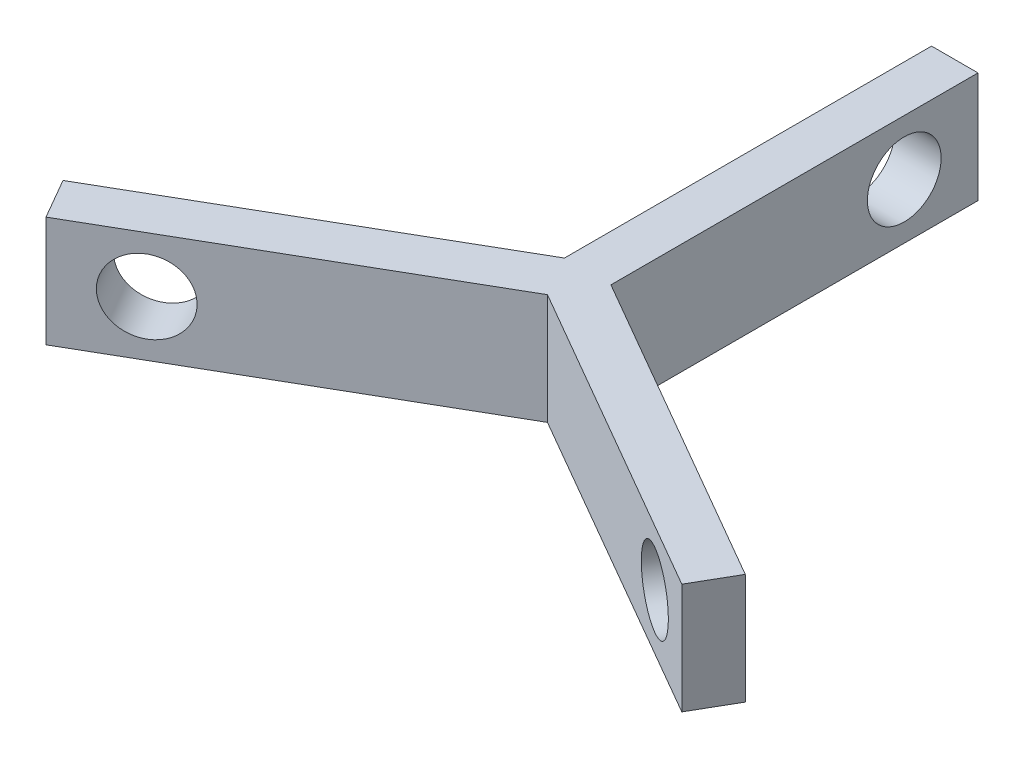
ISO-10303-21;
HEADER;
FILE_DESCRIPTION(('STEP AP214'),'2;1');
FILE_NAME('part.step','',(''),(''),'','','');
FILE_SCHEMA(('AUTOMOTIVE_DESIGN { 1 0 10303 214 1 1 1 1 }'));
ENDSEC;
DATA;
#1=APPLICATION_CONTEXT('core data for automotive mechanical design processes');
#2=APPLICATION_PROTOCOL_DEFINITION('international standard','automotive_design',2000,#1);
#3=PRODUCT_CONTEXT('',#1,'mechanical');
#4=PRODUCT('Part','Part','',(#3));
#5=PRODUCT_RELATED_PRODUCT_CATEGORY('part','',(#4));
#6=PRODUCT_DEFINITION_FORMATION('','',#4);
#7=PRODUCT_DEFINITION_CONTEXT('part definition',#1,'design');
#8=PRODUCT_DEFINITION('design','',#6,#7);
#9=PRODUCT_DEFINITION_SHAPE('','',#8);
#10=(LENGTH_UNIT() NAMED_UNIT(*) SI_UNIT(.MILLI.,.METRE.));
#11=(NAMED_UNIT(*) PLANE_ANGLE_UNIT() SI_UNIT($,.RADIAN.));
#12=(NAMED_UNIT(*) SI_UNIT($,.STERADIAN.) SOLID_ANGLE_UNIT());
#13=UNCERTAINTY_MEASURE_WITH_UNIT(LENGTH_MEASURE(1.E-05),#10,'distance_accuracy_value','');
#14=(GEOMETRIC_REPRESENTATION_CONTEXT(3) GLOBAL_UNCERTAINTY_ASSIGNED_CONTEXT((#13)) GLOBAL_UNIT_ASSIGNED_CONTEXT((#10,
#11,#12)) REPRESENTATION_CONTEXT('',''));
#15=CARTESIAN_POINT('',(0.,0.,0.));
#16=DIRECTION('',(0.,0.,1.));
#17=DIRECTION('',(1.,0.,0.));
#18=AXIS2_PLACEMENT_3D('',#15,#16,#17);
#19=CARTESIAN_POINT('',(2.5,5.9535,-40.9535));
#20=DIRECTION('',(-1.,0.,0.));
#21=DIRECTION('',(0.,0.,1.));
#22=AXIS2_PLACEMENT_3D('',#19,#20,#21);
#23=PLANE('',#22);
#24=CARTESIAN_POINT('',(2.49999999999977,0.,-33.0155));
#25=DIRECTION('',(1.,0.,0.));
#26=DIRECTION('',(0.,0.,-1.));
#27=AXIS2_PLACEMENT_3D('',#24,#25,#26);
#28=CIRCLE('',#27,3.969);
#29=CARTESIAN_POINT('',(2.49999999999975,0.,-36.9845));
#30=VERTEX_POINT('',#29);
#31=EDGE_CURVE('E207',#30,#30,#28,.T.);
#32=ORIENTED_EDGE('',*,*,#31,.F.);
#33=EDGE_LOOP('',(#32));
#34=FACE_BOUND('',#33,.T.);
#35=DIRECTION('',(0.,0.,-1.));
#36=VECTOR('',#35,1.);
#37=CARTESIAN_POINT('',(2.5,-5.9535,-40.9535));
#38=LINE('',#37,#36);
#39=CARTESIAN_POINT('',(2.5,-5.9535,-1.4433756729741));
#40=VERTEX_POINT('',#39);
#41=CARTESIAN_POINT('',(2.5,-5.9535,-40.9535));
#42=VERTEX_POINT('',#41);
#43=EDGE_CURVE('E140',#40,#42,#38,.T.);
#44=ORIENTED_EDGE('',*,*,#43,.T.);
#45=DIRECTION('',(0.,-1.,0.));
#46=VECTOR('',#45,1.);
#47=CARTESIAN_POINT('',(2.5,5.9535,-40.9535));
#48=LINE('',#47,#46);
#49=CARTESIAN_POINT('',(2.5,5.9535,-40.9535));
#50=VERTEX_POINT('',#49);
#51=EDGE_CURVE('E11',#50,#42,#48,.T.);
#52=ORIENTED_EDGE('',*,*,#51,.F.);
#53=DIRECTION('',(0.,0.,-1.));
#54=VECTOR('',#53,1.);
#55=CARTESIAN_POINT('',(2.5,5.9535,-40.9535));
#56=LINE('',#55,#54);
#57=CARTESIAN_POINT('',(2.5,5.9535,-1.4433756729741));
#58=VERTEX_POINT('',#57);
#59=EDGE_CURVE('E157',#58,#50,#56,.T.);
#60=ORIENTED_EDGE('',*,*,#59,.F.);
#61=DIRECTION('',(0.,-1.,0.));
#62=VECTOR('',#61,1.);
#63=CARTESIAN_POINT('',(2.5,5.9535,-1.4433756729741));
#64=LINE('',#63,#62);
#65=EDGE_CURVE('E136',#58,#40,#64,.T.);
#66=ORIENTED_EDGE('',*,*,#65,.T.);
#67=EDGE_LOOP('',(#44,#52,#60,#66));
#68=FACE_BOUND('',#67,.T.);
#69=ADVANCED_FACE('F38',(#34,#68),#23,.F.);
#70=CARTESIAN_POINT('',(-2.5,5.9535,-40.9535));
#71=DIRECTION('',(0.,0.,1.));
#72=DIRECTION('',(1.,0.,0.));
#73=AXIS2_PLACEMENT_3D('',#70,#71,#72);
#74=PLANE('',#73);
#75=DIRECTION('',(-1.,0.,0.));
#76=VECTOR('',#75,1.);
#77=CARTESIAN_POINT('',(-2.5,-5.9535,-40.9535));
#78=LINE('',#77,#76);
#79=CARTESIAN_POINT('',(-2.5,-5.9535,-40.9535));
#80=VERTEX_POINT('',#79);
#81=EDGE_CURVE('E143',#42,#80,#78,.T.);
#82=ORIENTED_EDGE('',*,*,#81,.T.);
#83=DIRECTION('',(0.,-1.,0.));
#84=VECTOR('',#83,1.);
#85=CARTESIAN_POINT('',(-2.5,5.9535,-40.9535));
#86=LINE('',#85,#84);
#87=CARTESIAN_POINT('',(-2.5,5.9535,-40.9535));
#88=VERTEX_POINT('',#87);
#89=EDGE_CURVE('E46',#88,#80,#86,.T.);
#90=ORIENTED_EDGE('',*,*,#89,.F.);
#91=DIRECTION('',(-1.,0.,0.));
#92=VECTOR('',#91,1.);
#93=CARTESIAN_POINT('',(-2.5,5.9535,-40.9535));
#94=LINE('',#93,#92);
#95=EDGE_CURVE('E100',#50,#88,#94,.T.);
#96=ORIENTED_EDGE('',*,*,#95,.F.);
#97=ORIENTED_EDGE('',*,*,#51,.T.);
#98=EDGE_LOOP('',(#82,#90,#96,#97));
#99=FACE_BOUND('',#98,.T.);
#100=ADVANCED_FACE('F221',(#99),#74,.F.);
#101=CARTESIAN_POINT('',(-2.5,5.9535,-40.9535));
#102=DIRECTION('',(1.,0.,0.));
#103=DIRECTION('',(0.,0.,-1.));
#104=AXIS2_PLACEMENT_3D('',#101,#102,#103);
#105=PLANE('',#104);
#106=CARTESIAN_POINT('',(-2.5,0.,-33.0154999999999));
#107=DIRECTION('',(1.,0.,0.));
#108=DIRECTION('',(0.,0.,-1.));
#109=AXIS2_PLACEMENT_3D('',#106,#107,#108);
#110=CIRCLE('',#109,3.969);
#111=CARTESIAN_POINT('',(-2.5,0.,-36.9844999999999));
#112=VERTEX_POINT('',#111);
#113=EDGE_CURVE('E203',#112,#112,#110,.F.);
#114=ORIENTED_EDGE('',*,*,#113,.F.);
#115=EDGE_LOOP('',(#114));
#116=FACE_BOUND('',#115,.T.);
#117=DIRECTION('',(0.,0.,1.));
#118=VECTOR('',#117,1.);
#119=CARTESIAN_POINT('',(-2.5,-5.9535,-40.9535));
#120=LINE('',#119,#118);
#121=CARTESIAN_POINT('',(-2.5,-5.9535,-1.4433756729741));
#122=VERTEX_POINT('',#121);
#123=EDGE_CURVE('E146',#80,#122,#120,.T.);
#124=ORIENTED_EDGE('',*,*,#123,.T.);
#125=DIRECTION('',(0.,-1.,0.));
#126=VECTOR('',#125,1.);
#127=CARTESIAN_POINT('',(-2.5,5.9535,-1.4433756729741));
#128=LINE('',#127,#126);
#129=CARTESIAN_POINT('',(-2.5,5.9535,-1.4433756729741));
#130=VERTEX_POINT('',#129);
#131=EDGE_CURVE('E167',#130,#122,#128,.T.);
#132=ORIENTED_EDGE('',*,*,#131,.F.);
#133=DIRECTION('',(0.,0.,1.));
#134=VECTOR('',#133,1.);
#135=CARTESIAN_POINT('',(-2.5,5.9535,-40.9535));
#136=LINE('',#135,#134);
#137=EDGE_CURVE('E175',#88,#130,#136,.T.);
#138=ORIENTED_EDGE('',*,*,#137,.F.);
#139=ORIENTED_EDGE('',*,*,#89,.T.);
#140=EDGE_LOOP('',(#124,#132,#138,#139));
#141=FACE_BOUND('',#140,.T.);
#142=ADVANCED_FACE('F173',(#116,#141),#105,.F.);
#143=CARTESIAN_POINT('',(-2.5,5.9535,-1.4433756729741));
#144=DIRECTION('',(0.499999999999999,0.,0.866025403784439));
#145=DIRECTION('',(0.866025403784439,0.,-0.499999999999999));
#146=AXIS2_PLACEMENT_3D('',#143,#144,#145);
#147=PLANE('',#146);
#148=CARTESIAN_POINT('',(-29.8422617186449,0.,14.3426864905392));
#149=DIRECTION('',(-0.50000000000001,0.,-0.866025403784433));
#150=DIRECTION('',(-0.866025403784433,0.,0.50000000000001));
#151=AXIS2_PLACEMENT_3D('',#148,#149,#150);
#152=CIRCLE('',#151,3.969);
#153=CARTESIAN_POINT('',(-33.2795165462653,0.,16.3271864905393));
#154=VERTEX_POINT('',#153);
#155=EDGE_CURVE('E208',#154,#154,#152,.T.);
#156=ORIENTED_EDGE('',*,*,#155,.F.);
#157=EDGE_LOOP('',(#156));
#158=FACE_BOUND('',#157,.T.);
#159=DIRECTION('',(-0.866025403784439,0.,0.499999999999999));
#160=VECTOR('',#159,1.);
#161=CARTESIAN_POINT('',(-2.5,-5.9535,-1.4433756729741));
#162=LINE('',#161,#160);
#163=CARTESIAN_POINT('',(-36.716771373886,-5.9535,18.3116864905388));
#164=VERTEX_POINT('',#163);
#165=EDGE_CURVE('E148',#122,#164,#162,.T.);
#166=ORIENTED_EDGE('',*,*,#165,.T.);
#167=DIRECTION('',(0.,-1.,0.));
#168=VECTOR('',#167,1.);
#169=CARTESIAN_POINT('',(-36.716771373886,5.9535,18.3116864905388));
#170=LINE('',#169,#168);
#171=CARTESIAN_POINT('',(-36.716771373886,5.9535,18.3116864905388));
#172=VERTEX_POINT('',#171);
#173=EDGE_CURVE('E164',#172,#164,#170,.T.);
#174=ORIENTED_EDGE('',*,*,#173,.F.);
#175=DIRECTION('',(-0.866025403784439,0.,0.499999999999999));
#176=VECTOR('',#175,1.);
#177=CARTESIAN_POINT('',(-2.5,5.9535,-1.4433756729741));
#178=LINE('',#177,#176);
#179=EDGE_CURVE('E191',#130,#172,#178,.T.);
#180=ORIENTED_EDGE('',*,*,#179,.F.);
#181=ORIENTED_EDGE('',*,*,#131,.T.);
#182=EDGE_LOOP('',(#166,#174,#180,#181));
#183=FACE_BOUND('',#182,.T.);
#184=ADVANCED_FACE('F184',(#158,#183),#147,.F.);
#185=CARTESIAN_POINT('',(-36.716771373886,5.9535,18.3116864905388));
#186=DIRECTION('',(0.866025403784439,0.,-0.499999999999999));
#187=DIRECTION('',(-0.499999999999999,0.,-0.866025403784439));
#188=AXIS2_PLACEMENT_3D('',#185,#186,#187);
#189=PLANE('',#188);
#190=DIRECTION('',(0.499999999999999,0.,0.866025403784439));
#191=VECTOR('',#190,1.);
#192=CARTESIAN_POINT('',(-36.716771373886,-5.9535,18.3116864905388));
#193=LINE('',#192,#191);
#194=CARTESIAN_POINT('',(-34.216771373886,-5.9535,22.641813509461));
#195=VERTEX_POINT('',#194);
#196=EDGE_CURVE('E150',#164,#195,#193,.T.);
#197=ORIENTED_EDGE('',*,*,#196,.T.);
#198=DIRECTION('',(0.,-1.,0.));
#199=VECTOR('',#198,1.);
#200=CARTESIAN_POINT('',(-34.216771373886,5.9535,22.641813509461));
#201=LINE('',#200,#199);
#202=CARTESIAN_POINT('',(-34.216771373886,5.9535,22.641813509461));
#203=VERTEX_POINT('',#202);
#204=EDGE_CURVE('E161',#203,#195,#201,.T.);
#205=ORIENTED_EDGE('',*,*,#204,.F.);
#206=DIRECTION('',(0.499999999999999,0.,0.866025403784439));
#207=VECTOR('',#206,1.);
#208=CARTESIAN_POINT('',(-36.716771373886,5.9535,18.3116864905388));
#209=LINE('',#208,#207);
#210=EDGE_CURVE('E190',#172,#203,#209,.T.);
#211=ORIENTED_EDGE('',*,*,#210,.F.);
#212=ORIENTED_EDGE('',*,*,#173,.T.);
#213=EDGE_LOOP('',(#197,#205,#211,#212));
#214=FACE_BOUND('',#213,.T.);
#215=ADVANCED_FACE('F188',(#214),#189,.F.);
#216=CARTESIAN_POINT('',(-34.216771373886,5.9535,22.641813509461));
#217=DIRECTION('',(-0.499999999999998,0.,-0.86602540378444));
#218=DIRECTION('',(-0.86602540378444,0.,0.499999999999998));
#219=AXIS2_PLACEMENT_3D('',#216,#217,#218);
#220=PLANE('',#219);
#221=CARTESIAN_POINT('',(-27.3422617186451,0.,18.672813509461));
#222=DIRECTION('',(-0.499999999999998,0.,-0.86602540378444));
#223=DIRECTION('',(-0.86602540378444,0.,0.499999999999998));
#224=AXIS2_PLACEMENT_3D('',#221,#222,#223);
#225=CIRCLE('',#224,3.969);
#226=CARTESIAN_POINT('',(-30.7795165462656,0.,20.657313509461));
#227=VERTEX_POINT('',#226);
#228=EDGE_CURVE('E204',#227,#227,#225,.F.);
#229=ORIENTED_EDGE('',*,*,#228,.F.);
#230=EDGE_LOOP('',(#229));
#231=FACE_BOUND('',#230,.T.);
#232=DIRECTION('',(0.86602540378444,0.,-0.499999999999998));
#233=VECTOR('',#232,1.);
#234=CARTESIAN_POINT('',(-34.216771373886,-5.9535,22.641813509461));
#235=LINE('',#234,#233);
#236=CARTESIAN_POINT('',(0.,-5.9535,2.88675134594812));
#237=VERTEX_POINT('',#236);
#238=EDGE_CURVE('E152',#195,#237,#235,.T.);
#239=ORIENTED_EDGE('',*,*,#238,.T.);
#240=DIRECTION('',(0.,-1.,0.));
#241=VECTOR('',#240,1.);
#242=CARTESIAN_POINT('',(0.,5.9535,2.88675134594812));
#243=LINE('',#242,#241);
#244=CARTESIAN_POINT('',(0.,5.9535,2.88675134594812));
#245=VERTEX_POINT('',#244);
#246=EDGE_CURVE('E131',#245,#237,#243,.T.);
#247=ORIENTED_EDGE('',*,*,#246,.F.);
#248=DIRECTION('',(0.86602540378444,0.,-0.499999999999998));
#249=VECTOR('',#248,1.);
#250=CARTESIAN_POINT('',(-34.216771373886,5.9535,22.641813509461));
#251=LINE('',#250,#249);
#252=EDGE_CURVE('E122',#203,#245,#251,.T.);
#253=ORIENTED_EDGE('',*,*,#252,.F.);
#254=ORIENTED_EDGE('',*,*,#204,.T.);
#255=EDGE_LOOP('',(#239,#247,#253,#254));
#256=FACE_BOUND('',#255,.T.);
#257=ADVANCED_FACE('F225',(#231,#256),#220,.F.);
#258=CARTESIAN_POINT('',(0.,5.9535,2.88675134594812));
#259=DIRECTION('',(0.499999999999998,0.,-0.86602540378444));
#260=DIRECTION('',(-0.86602540378444,0.,-0.499999999999998));
#261=AXIS2_PLACEMENT_3D('',#258,#259,#260);
#262=PLANE('',#261);
#263=CARTESIAN_POINT('',(27.3422617186451,0.,18.672813509461));
#264=DIRECTION('',(-0.499999999999998,0.,0.86602540378444));
#265=DIRECTION('',(0.86602540378444,0.,0.499999999999998));
#266=AXIS2_PLACEMENT_3D('',#263,#264,#265);
#267=CIRCLE('',#266,3.969);
#268=CARTESIAN_POINT('',(30.7795165462656,0.,20.657313509461));
#269=VERTEX_POINT('',#268);
#270=EDGE_CURVE('E200',#269,#269,#267,.T.);
#271=ORIENTED_EDGE('',*,*,#270,.F.);
#272=EDGE_LOOP('',(#271));
#273=FACE_BOUND('',#272,.T.);
#274=DIRECTION('',(0.86602540378444,0.,0.499999999999998));
#275=VECTOR('',#274,1.);
#276=CARTESIAN_POINT('',(0.,-5.9535,2.88675134594812));
#277=LINE('',#276,#275);
#278=CARTESIAN_POINT('',(34.216771373886,-5.9535,22.641813509461));
#279=VERTEX_POINT('',#278);
#280=EDGE_CURVE('E130',#237,#279,#277,.T.);
#281=ORIENTED_EDGE('',*,*,#280,.T.);
#282=DIRECTION('',(0.,-1.,0.));
#283=VECTOR('',#282,1.);
#284=CARTESIAN_POINT('',(34.216771373886,5.9535,22.641813509461));
#285=LINE('',#284,#283);
#286=CARTESIAN_POINT('',(34.216771373886,5.9535,22.641813509461));
#287=VERTEX_POINT('',#286);
#288=EDGE_CURVE('E127',#287,#279,#285,.T.);
#289=ORIENTED_EDGE('',*,*,#288,.F.);
#290=DIRECTION('',(0.86602540378444,0.,0.499999999999998));
#291=VECTOR('',#290,1.);
#292=CARTESIAN_POINT('',(0.,5.9535,2.88675134594812));
#293=LINE('',#292,#291);
#294=EDGE_CURVE('E116',#245,#287,#293,.T.);
#295=ORIENTED_EDGE('',*,*,#294,.F.);
#296=ORIENTED_EDGE('',*,*,#246,.T.);
#297=EDGE_LOOP('',(#281,#289,#295,#296));
#298=FACE_BOUND('',#297,.T.);
#299=ADVANCED_FACE('F128',(#273,#298),#262,.F.);
#300=CARTESIAN_POINT('',(34.216771373886,5.9535,22.641813509461));
#301=DIRECTION('',(-0.86602540378444,0.,-0.499999999999997));
#302=DIRECTION('',(-0.499999999999997,0.,0.86602540378444));
#303=AXIS2_PLACEMENT_3D('',#300,#301,#302);
#304=PLANE('',#303);
#305=DIRECTION('',(0.499999999999997,0.,-0.86602540378444));
#306=VECTOR('',#305,1.);
#307=CARTESIAN_POINT('',(34.216771373886,-5.9535,22.641813509461));
#308=LINE('',#307,#306);
#309=CARTESIAN_POINT('',(36.716771373886,-5.9535,18.3116864905388));
#310=VERTEX_POINT('',#309);
#311=EDGE_CURVE('E86',#279,#310,#308,.T.);
#312=ORIENTED_EDGE('',*,*,#311,.T.);
#313=DIRECTION('',(0.,-1.,0.));
#314=VECTOR('',#313,1.);
#315=CARTESIAN_POINT('',(36.716771373886,5.9535,18.3116864905388));
#316=LINE('',#315,#314);
#317=CARTESIAN_POINT('',(36.716771373886,5.9535,18.3116864905388));
#318=VERTEX_POINT('',#317);
#319=EDGE_CURVE('E132',#318,#310,#316,.T.);
#320=ORIENTED_EDGE('',*,*,#319,.F.);
#321=DIRECTION('',(0.499999999999997,0.,-0.86602540378444));
#322=VECTOR('',#321,1.);
#323=CARTESIAN_POINT('',(34.216771373886,5.9535,22.641813509461));
#324=LINE('',#323,#322);
#325=EDGE_CURVE('E120',#287,#318,#324,.T.);
#326=ORIENTED_EDGE('',*,*,#325,.F.);
#327=ORIENTED_EDGE('',*,*,#288,.T.);
#328=EDGE_LOOP('',(#312,#320,#326,#327));
#329=FACE_BOUND('',#328,.T.);
#330=ADVANCED_FACE('F134',(#329),#304,.F.);
#331=CARTESIAN_POINT('',(2.5,5.9535,-1.4433756729741));
#332=DIRECTION('',(-0.499999999999999,0.,0.866025403784439));
#333=DIRECTION('',(0.866025403784439,0.,0.499999999999999));
#334=AXIS2_PLACEMENT_3D('',#331,#332,#333);
#335=PLANE('',#334);
#336=CARTESIAN_POINT('',(29.8422617186451,0.,14.3426864905388));
#337=DIRECTION('',(-0.499999999999999,0.,0.866025403784439));
#338=DIRECTION('',(0.866025403784439,0.,0.499999999999999));
#339=AXIS2_PLACEMENT_3D('',#336,#337,#338);
#340=CIRCLE('',#339,3.969);
#341=CARTESIAN_POINT('',(33.2795165462656,0.,16.3271864905388));
#342=VERTEX_POINT('',#341);
#343=EDGE_CURVE('E144',#342,#342,#340,.F.);
#344=ORIENTED_EDGE('',*,*,#343,.F.);
#345=EDGE_LOOP('',(#344));
#346=FACE_BOUND('',#345,.T.);
#347=DIRECTION('',(-0.866025403784439,0.,-0.499999999999999));
#348=VECTOR('',#347,1.);
#349=CARTESIAN_POINT('',(2.5,-5.9535,-1.4433756729741));
#350=LINE('',#349,#348);
#351=EDGE_CURVE('E92',#310,#40,#350,.T.);
#352=ORIENTED_EDGE('',*,*,#351,.T.);
#353=ORIENTED_EDGE('',*,*,#65,.F.);
#354=DIRECTION('',(-0.866025403784439,0.,-0.499999999999999));
#355=VECTOR('',#354,1.);
#356=CARTESIAN_POINT('',(2.5,5.9535,-1.4433756729741));
#357=LINE('',#356,#355);
#358=EDGE_CURVE('E54',#318,#58,#357,.T.);
#359=ORIENTED_EDGE('',*,*,#358,.F.);
#360=ORIENTED_EDGE('',*,*,#319,.T.);
#361=EDGE_LOOP('',(#352,#353,#359,#360));
#362=FACE_BOUND('',#361,.T.);
#363=ADVANCED_FACE('F271',(#346,#362),#335,.F.);
#364=CARTESIAN_POINT('',(0.,5.9535,0.));
#365=DIRECTION('',(0.,1.,0.));
#366=DIRECTION('',(0.,0.,1.));
#367=AXIS2_PLACEMENT_3D('',#364,#365,#366);
#368=PLANE('',#367);
#369=ORIENTED_EDGE('',*,*,#59,.T.);
#370=ORIENTED_EDGE('',*,*,#95,.T.);
#371=ORIENTED_EDGE('',*,*,#137,.T.);
#372=ORIENTED_EDGE('',*,*,#179,.T.);
#373=ORIENTED_EDGE('',*,*,#210,.T.);
#374=ORIENTED_EDGE('',*,*,#252,.T.);
#375=ORIENTED_EDGE('',*,*,#294,.T.);
#376=ORIENTED_EDGE('',*,*,#325,.T.);
#377=ORIENTED_EDGE('',*,*,#358,.T.);
#378=EDGE_LOOP('',(#369,#370,#371,#372,#373,#374,#375,#376,#377));
#379=FACE_BOUND('',#378,.T.);
#380=ADVANCED_FACE('F118',(#379),#368,.T.);
#381=CARTESIAN_POINT('',(0.,-5.9535,0.));
#382=DIRECTION('',(0.,1.,0.));
#383=DIRECTION('',(0.,0.,1.));
#384=AXIS2_PLACEMENT_3D('',#381,#382,#383);
#385=PLANE('',#384);
#386=ORIENTED_EDGE('',*,*,#43,.F.);
#387=ORIENTED_EDGE('',*,*,#351,.F.);
#388=ORIENTED_EDGE('',*,*,#311,.F.);
#389=ORIENTED_EDGE('',*,*,#280,.F.);
#390=ORIENTED_EDGE('',*,*,#238,.F.);
#391=ORIENTED_EDGE('',*,*,#196,.F.);
#392=ORIENTED_EDGE('',*,*,#165,.F.);
#393=ORIENTED_EDGE('',*,*,#123,.F.);
#394=ORIENTED_EDGE('',*,*,#81,.F.);
#395=EDGE_LOOP('',(#386,#387,#388,#389,#390,#391,#392,#393,#394));
#396=FACE_BOUND('',#395,.T.);
#397=ADVANCED_FACE('F179',(#396),#385,.F.);
#398=CARTESIAN_POINT('',(55.5055232617614,0.,-30.1073863900673));
#399=DIRECTION('',(-0.499999999999998,0.,0.86602540378444));
#400=DIRECTION('',(0.86602540378444,0.,0.499999999999998));
#401=AXIS2_PLACEMENT_3D('',#398,#399,#400);
#402=CYLINDRICAL_SURFACE('',#401,3.969);
#403=ORIENTED_EDGE('',*,*,#270,.T.);
#404=EDGE_LOOP('',(#403));
#405=FACE_BOUND('',#404,.T.);
#406=ORIENTED_EDGE('',*,*,#343,.T.);
#407=EDGE_LOOP('',(#406));
#408=FACE_BOUND('',#407,.T.);
#409=ADVANCED_FACE('F290',(#405,#408),#402,.F.);
#410=CARTESIAN_POINT('',(-9.60819301899956,0.,49.3891215221632));
#411=DIRECTION('',(-0.50000000000001,0.,-0.866025403784433));
#412=DIRECTION('',(-0.866025403784433,0.,0.50000000000001));
#413=AXIS2_PLACEMENT_3D('',#410,#411,#412);
#414=CYLINDRICAL_SURFACE('',#413,3.969);
#415=ORIENTED_EDGE('',*,*,#155,.T.);
#416=EDGE_LOOP('',(#415));
#417=FACE_BOUND('',#416,.T.);
#418=ORIENTED_EDGE('',*,*,#228,.T.);
#419=EDGE_LOOP('',(#418));
#420=FACE_BOUND('',#419,.T.);
#421=ADVANCED_FACE('F310',(#417,#420),#414,.F.);
#422=CARTESIAN_POINT('',(-36.7177713738864,0.,-33.0154999999997));
#423=DIRECTION('',(1.,0.,0.));
#424=DIRECTION('',(0.,0.,-1.));
#425=AXIS2_PLACEMENT_3D('',#422,#423,#424);
#426=CYLINDRICAL_SURFACE('',#425,3.969);
#427=ORIENTED_EDGE('',*,*,#31,.T.);
#428=EDGE_LOOP('',(#427));
#429=FACE_BOUND('',#428,.T.);
#430=ORIENTED_EDGE('',*,*,#113,.T.);
#431=EDGE_LOOP('',(#430));
#432=FACE_BOUND('',#431,.T.);
#433=ADVANCED_FACE('F216',(#429,#432),#426,.F.);
#434=CLOSED_SHELL('',(#69,#100,#142,#184,#215,#257,#299,#330,#363,#380,#397,#409,#421,#433));
#435=MANIFOLD_SOLID_BREP('B2',#434);
#436=ADVANCED_BREP_SHAPE_REPRESENTATION('',(#18,#435),#14);
#437=SHAPE_DEFINITION_REPRESENTATION(#9,#436);
ENDSEC;
END-ISO-10303-21;
